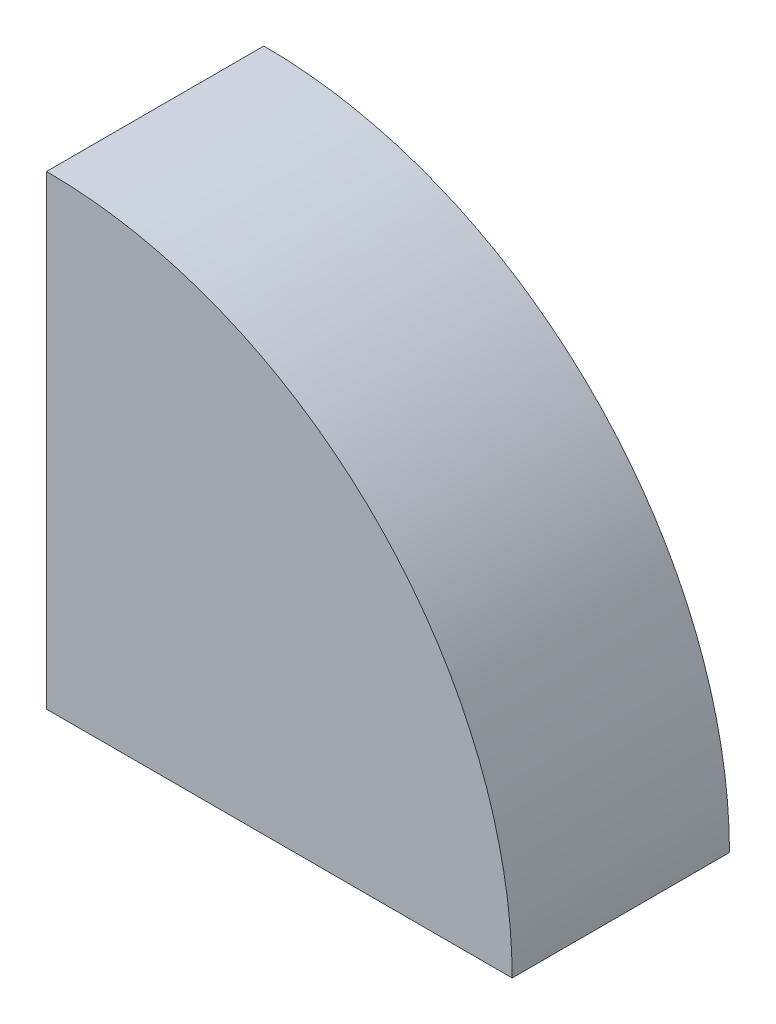
ISO-10303-21;
HEADER;
FILE_DESCRIPTION(('STEP AP214'),'2;1');
FILE_NAME('part.step','',(''),(''),'','','');
FILE_SCHEMA(('AUTOMOTIVE_DESIGN { 1 0 10303 214 1 1 1 1 }'));
ENDSEC;
DATA;
#1=APPLICATION_CONTEXT('core data for automotive mechanical design processes');
#2=APPLICATION_PROTOCOL_DEFINITION('international standard','automotive_design',2000,#1);
#3=PRODUCT_CONTEXT('',#1,'mechanical');
#4=PRODUCT('Part','Part','',(#3));
#5=PRODUCT_RELATED_PRODUCT_CATEGORY('part','',(#4));
#6=PRODUCT_DEFINITION_FORMATION('','',#4);
#7=PRODUCT_DEFINITION_CONTEXT('part definition',#1,'design');
#8=PRODUCT_DEFINITION('design','',#6,#7);
#9=PRODUCT_DEFINITION_SHAPE('','',#8);
#10=(LENGTH_UNIT() NAMED_UNIT(*) SI_UNIT(.MILLI.,.METRE.));
#11=(NAMED_UNIT(*) PLANE_ANGLE_UNIT() SI_UNIT($,.RADIAN.));
#12=(NAMED_UNIT(*) SI_UNIT($,.STERADIAN.) SOLID_ANGLE_UNIT());
#13=UNCERTAINTY_MEASURE_WITH_UNIT(LENGTH_MEASURE(1.E-05),#10,'distance_accuracy_value','');
#14=(GEOMETRIC_REPRESENTATION_CONTEXT(3) GLOBAL_UNCERTAINTY_ASSIGNED_CONTEXT((#13)) GLOBAL_UNIT_ASSIGNED_CONTEXT((#10,
#11,#12)) REPRESENTATION_CONTEXT('',''));
#15=CARTESIAN_POINT('',(0.,0.,0.));
#16=DIRECTION('',(0.,0.,1.));
#17=DIRECTION('',(1.,0.,0.));
#18=AXIS2_PLACEMENT_3D('',#15,#16,#17);
#19=CARTESIAN_POINT('',(2.2,2.2,108.483787187234));
#20=DIRECTION('',(0.,0.,-1.));
#21=DIRECTION('',(-1.,0.,0.));
#22=AXIS2_PLACEMENT_3D('',#19,#20,#21);
#23=CYLINDRICAL_SURFACE('',#22,55.8);
#24=DIRECTION('',(0.,0.,-1.));
#25=VECTOR('',#24,1.);
#26=CARTESIAN_POINT('',(2.2,58.,108.483787187234));
#27=LINE('',#26,#25);
#28=CARTESIAN_POINT('',(2.19999999999995,58.,20.8));
#29=VERTEX_POINT('',#28);
#30=CARTESIAN_POINT('',(2.19999999999995,58.,7.2));
#31=VERTEX_POINT('',#30);
#32=EDGE_CURVE('E517',#29,#31,#27,.T.);
#33=ORIENTED_EDGE('',*,*,#32,.T.);
#34=CARTESIAN_POINT('',(2.2,2.2,7.2));
#35=DIRECTION('',(0.,0.,-1.));
#36=DIRECTION('',(0.,1.,0.));
#37=AXIS2_PLACEMENT_3D('',#34,#35,#36);
#38=CIRCLE('',#37,55.8);
#39=CARTESIAN_POINT('',(3.49999999999996,57.9848545754132,7.2));
#40=VERTEX_POINT('',#39);
#41=EDGE_CURVE('E514',#31,#40,#38,.T.);
#42=ORIENTED_EDGE('',*,*,#41,.T.);
#43=DIRECTION('',(0.,0.,-1.));
#44=VECTOR('',#43,1.);
#45=CARTESIAN_POINT('',(3.49999999999996,57.9848545754132,7.2));
#46=LINE('',#45,#44);
#47=CARTESIAN_POINT('',(3.49999999999996,57.9848545754132,3.4));
#48=VERTEX_POINT('',#47);
#49=EDGE_CURVE('E257',#40,#48,#46,.T.);
#50=ORIENTED_EDGE('',*,*,#49,.T.);
#51=CARTESIAN_POINT('',(2.19999999999995,58.,3.4));
#52=CARTESIAN_POINT('',(2.85008822457151,58.,3.4));
#53=CARTESIAN_POINT('',(3.49999999999996,57.9848545754132,3.4));
#54=B_SPLINE_CURVE_WITH_KNOTS('',2,(#51,#52,#53),.UNSPECIFIED.,.F.,.F.,(3,3),(0.,1.),.UNSPECIFIED.);
#55=CARTESIAN_POINT('',(2.19999999999995,58.,3.4));
#56=VERTEX_POINT('',#55);
#57=EDGE_CURVE('E266',#56,#48,#54,.T.);
#58=ORIENTED_EDGE('',*,*,#57,.F.);
#59=CARTESIAN_POINT('',(2.2,58.,2.));
#60=VERTEX_POINT('',#59);
#61=EDGE_CURVE('E439',#56,#60,#27,.T.);
#62=ORIENTED_EDGE('',*,*,#61,.T.);
#63=CARTESIAN_POINT('',(2.2,2.2,2.));
#64=DIRECTION('',(0.,0.,1.));
#65=DIRECTION('',(1.,0.,0.));
#66=AXIS2_PLACEMENT_3D('',#63,#64,#65);
#67=CIRCLE('',#66,55.8);
#68=CARTESIAN_POINT('',(58.,2.2,2.));
#69=VERTEX_POINT('',#68);
#70=EDGE_CURVE('E422',#69,#60,#67,.T.);
#71=ORIENTED_EDGE('',*,*,#70,.F.);
#72=DIRECTION('',(0.,0.,-1.));
#73=VECTOR('',#72,1.);
#74=CARTESIAN_POINT('',(58.,2.2,108.483787187234));
#75=LINE('',#74,#73);
#76=CARTESIAN_POINT('',(58.,2.2,3.4));
#77=VERTEX_POINT('',#76);
#78=EDGE_CURVE('E599',#77,#69,#75,.T.);
#79=ORIENTED_EDGE('',*,*,#78,.F.);
#80=CARTESIAN_POINT('',(2.2,2.2,3.4));
#81=DIRECTION('',(0.,0.,1.));
#82=DIRECTION('',(1.,0.,0.));
#83=AXIS2_PLACEMENT_3D('',#80,#81,#82);
#84=CIRCLE('',#83,55.8);
#85=CARTESIAN_POINT('',(57.9848545754132,3.50000000000013,3.4));
#86=VERTEX_POINT('',#85);
#87=EDGE_CURVE('E357',#77,#86,#84,.T.);
#88=ORIENTED_EDGE('',*,*,#87,.T.);
#89=DIRECTION('',(0.,0.,-1.));
#90=VECTOR('',#89,1.);
#91=CARTESIAN_POINT('',(57.9848545754132,3.5,7.2));
#92=LINE('',#91,#90);
#93=CARTESIAN_POINT('',(57.9848545754132,3.5,7.2));
#94=VERTEX_POINT('',#93);
#95=EDGE_CURVE('E348',#94,#86,#92,.T.);
#96=ORIENTED_EDGE('',*,*,#95,.F.);
#97=CARTESIAN_POINT('',(58.,2.20000000000001,7.2));
#98=CARTESIAN_POINT('',(58.,2.85008822457154,7.2));
#99=CARTESIAN_POINT('',(57.9848545754132,3.5,7.2));
#100=B_SPLINE_CURVE_WITH_KNOTS('',2,(#97,#98,#99),.UNSPECIFIED.,.F.,.F.,(3,3),(0.,1.),.UNSPECIFIED.);
#101=CARTESIAN_POINT('',(58.,2.2,7.2));
#102=VERTEX_POINT('',#101);
#103=EDGE_CURVE('E685',#102,#94,#100,.T.);
#104=ORIENTED_EDGE('',*,*,#103,.F.);
#105=CARTESIAN_POINT('',(58.,2.2,20.8));
#106=VERTEX_POINT('',#105);
#107=EDGE_CURVE('E448',#106,#102,#75,.T.);
#108=ORIENTED_EDGE('',*,*,#107,.F.);
#109=CARTESIAN_POINT('',(2.2,2.2,20.8));
#110=DIRECTION('',(0.,0.,1.));
#111=DIRECTION('',(1.,0.,0.));
#112=AXIS2_PLACEMENT_3D('',#109,#110,#111);
#113=CIRCLE('',#112,55.8);
#114=CARTESIAN_POINT('',(57.9848545754132,3.5000000000003,20.8));
#115=VERTEX_POINT('',#114);
#116=EDGE_CURVE('E434',#106,#115,#113,.T.);
#117=ORIENTED_EDGE('',*,*,#116,.T.);
#118=DIRECTION('',(0.,0.,1.));
#119=VECTOR('',#118,1.);
#120=CARTESIAN_POINT('',(57.9848545754132,3.5,20.8));
#121=LINE('',#120,#119);
#122=CARTESIAN_POINT('',(57.9848545754132,3.50000000000001,24.6));
#123=VERTEX_POINT('',#122);
#124=EDGE_CURVE('E673',#115,#123,#121,.T.);
#125=ORIENTED_EDGE('',*,*,#124,.T.);
#126=CARTESIAN_POINT('',(58.,2.2,24.6));
#127=CARTESIAN_POINT('',(58.,2.85008822457155,24.6));
#128=CARTESIAN_POINT('',(57.9848545754132,3.5,24.6));
#129=B_SPLINE_CURVE_WITH_KNOTS('',2,(#126,#127,#128),.UNSPECIFIED.,.F.,.F.,(3,3),(0.,1.),.UNSPECIFIED.);
#130=CARTESIAN_POINT('',(58.,2.19999999999999,24.6));
#131=VERTEX_POINT('',#130);
#132=EDGE_CURVE('E672',#131,#123,#129,.T.);
#133=ORIENTED_EDGE('',*,*,#132,.F.);
#134=CARTESIAN_POINT('',(58.,2.2,26.));
#135=VERTEX_POINT('',#134);
#136=EDGE_CURVE('E426',#135,#131,#75,.T.);
#137=ORIENTED_EDGE('',*,*,#136,.F.);
#138=CARTESIAN_POINT('',(2.2,2.2,26.));
#139=DIRECTION('',(0.,0.,1.));
#140=DIRECTION('',(1.,0.,0.));
#141=AXIS2_PLACEMENT_3D('',#138,#139,#140);
#142=CIRCLE('',#141,55.8);
#143=CARTESIAN_POINT('',(2.2,58.,26.));
#144=VERTEX_POINT('',#143);
#145=EDGE_CURVE('E421',#135,#144,#142,.T.);
#146=ORIENTED_EDGE('',*,*,#145,.T.);
#147=CARTESIAN_POINT('',(2.2,58.,24.6));
#148=VERTEX_POINT('',#147);
#149=EDGE_CURVE('E598',#144,#148,#27,.T.);
#150=ORIENTED_EDGE('',*,*,#149,.T.);
#151=CARTESIAN_POINT('',(2.2,2.2,24.6));
#152=DIRECTION('',(0.,0.,-1.));
#153=DIRECTION('',(0.,1.,0.));
#154=AXIS2_PLACEMENT_3D('',#151,#152,#153);
#155=CIRCLE('',#154,55.8);
#156=CARTESIAN_POINT('',(3.49999999999996,57.9848545754132,24.6));
#157=VERTEX_POINT('',#156);
#158=EDGE_CURVE('E543',#148,#157,#155,.T.);
#159=ORIENTED_EDGE('',*,*,#158,.T.);
#160=DIRECTION('',(0.,0.,1.));
#161=VECTOR('',#160,1.);
#162=CARTESIAN_POINT('',(3.49999999999996,57.9848545754132,20.8));
#163=LINE('',#162,#161);
#164=CARTESIAN_POINT('',(3.49999999999996,57.9848545754132,20.8));
#165=VERTEX_POINT('',#164);
#166=EDGE_CURVE('E537',#165,#157,#163,.T.);
#167=ORIENTED_EDGE('',*,*,#166,.F.);
#168=CARTESIAN_POINT('',(2.19999999999995,58.,20.8));
#169=CARTESIAN_POINT('',(2.85008822457152,58.,20.8));
#170=CARTESIAN_POINT('',(3.49999999999997,57.9848545754132,20.8));
#171=B_SPLINE_CURVE_WITH_KNOTS('',2,(#168,#169,#170),.UNSPECIFIED.,.F.,.F.,(3,3),(0.,1.),.UNSPECIFIED.);
#172=EDGE_CURVE('E341',#29,#165,#171,.T.);
#173=ORIENTED_EDGE('',*,*,#172,.F.);
#174=EDGE_LOOP('',(#33,#42,#50,#58,#62,#71,#79,#88,#96,#104,#108,#117,#125,#133,#137,#146,#150,
#159,#167,#173));
#175=FACE_BOUND('',#174,.T.);
#176=ADVANCED_FACE('F18',(#175),#23,.F.);
#177=CARTESIAN_POINT('',(0.,57.,28.));
#178=DIRECTION('',(0.,1.,0.));
#179=DIRECTION('',(0.,0.,1.));
#180=AXIS2_PLACEMENT_3D('',#177,#178,#179);
#181=PLANE('',#180);
#182=DIRECTION('',(0.,0.,-1.));
#183=VECTOR('',#182,1.);
#184=CARTESIAN_POINT('',(2.2,57.,108.483787187234));
#185=LINE('',#184,#183);
#186=CARTESIAN_POINT('',(2.19999999999999,57.,26.));
#187=VERTEX_POINT('',#186);
#188=CARTESIAN_POINT('',(2.19999999999996,57.,24.6));
#189=VERTEX_POINT('',#188);
#190=EDGE_CURVE('E440',#187,#189,#185,.T.);
#191=ORIENTED_EDGE('',*,*,#190,.F.);
#192=DIRECTION('',(-1.,0.,0.));
#193=VECTOR('',#192,1.);
#194=CARTESIAN_POINT('',(0.,57.,26.));
#195=LINE('',#194,#193);
#196=CARTESIAN_POINT('',(0.,57.,26.));
#197=VERTEX_POINT('',#196);
#198=EDGE_CURVE('E37',#187,#197,#195,.T.);
#199=ORIENTED_EDGE('',*,*,#198,.T.);
#200=DIRECTION('',(0.,0.,-1.));
#201=VECTOR('',#200,1.);
#202=CARTESIAN_POINT('',(0.,57.,28.));
#203=LINE('',#202,#201);
#204=CARTESIAN_POINT('',(0.,57.,0.));
#205=VERTEX_POINT('',#204);
#206=EDGE_CURVE('E29',#197,#205,#203,.T.);
#207=ORIENTED_EDGE('',*,*,#206,.T.);
#208=DIRECTION('',(1.,0.,0.));
#209=VECTOR('',#208,1.);
#210=CARTESIAN_POINT('',(0.,57.,0.));
#211=LINE('',#210,#209);
#212=CARTESIAN_POINT('',(5.,57.,0.));
#213=VERTEX_POINT('',#212);
#214=EDGE_CURVE('E654',#205,#213,#211,.T.);
#215=ORIENTED_EDGE('',*,*,#214,.T.);
#216=DIRECTION('',(0.,0.,-1.));
#217=VECTOR('',#216,1.);
#218=CARTESIAN_POINT('',(5.,57.,28.));
#219=LINE('',#218,#217);
#220=CARTESIAN_POINT('',(5.,57.,2.));
#221=VERTEX_POINT('',#220);
#222=EDGE_CURVE('E668',#221,#213,#219,.T.);
#223=ORIENTED_EDGE('',*,*,#222,.F.);
#224=DIRECTION('',(1.,0.,0.));
#225=VECTOR('',#224,1.);
#226=CARTESIAN_POINT('',(0.,57.,2.));
#227=LINE('',#226,#225);
#228=CARTESIAN_POINT('',(2.2,57.,2.));
#229=VERTEX_POINT('',#228);
#230=EDGE_CURVE('E611',#229,#221,#227,.T.);
#231=ORIENTED_EDGE('',*,*,#230,.F.);
#232=CARTESIAN_POINT('',(2.2,57.,3.4));
#233=VERTEX_POINT('',#232);
#234=EDGE_CURVE('E420',#233,#229,#185,.T.);
#235=ORIENTED_EDGE('',*,*,#234,.F.);
#236=DIRECTION('',(1.,0.,0.));
#237=VECTOR('',#236,1.);
#238=CARTESIAN_POINT('',(2.19999999999996,57.,3.4));
#239=LINE('',#238,#237);
#240=CARTESIAN_POINT('',(0.999999999999965,57.,3.4));
#241=VERTEX_POINT('',#240);
#242=EDGE_CURVE('E235',#241,#233,#239,.T.);
#243=ORIENTED_EDGE('',*,*,#242,.F.);
#244=DIRECTION('',(0.,0.,-1.));
#245=VECTOR('',#244,1.);
#246=CARTESIAN_POINT('',(0.999999999999965,57.,7.2));
#247=LINE('',#246,#245);
#248=CARTESIAN_POINT('',(0.999999999999965,57.,7.2));
#249=VERTEX_POINT('',#248);
#250=EDGE_CURVE('E264',#249,#241,#247,.T.);
#251=ORIENTED_EDGE('',*,*,#250,.F.);
#252=DIRECTION('',(1.,0.,0.));
#253=VECTOR('',#252,1.);
#254=CARTESIAN_POINT('',(2.19999999999996,57.,7.2));
#255=LINE('',#254,#253);
#256=CARTESIAN_POINT('',(2.19999999999996,57.,7.2));
#257=VERTEX_POINT('',#256);
#258=EDGE_CURVE('E249',#249,#257,#255,.T.);
#259=ORIENTED_EDGE('',*,*,#258,.T.);
#260=CARTESIAN_POINT('',(2.19999999999996,57.,20.8));
#261=VERTEX_POINT('',#260);
#262=EDGE_CURVE('E606',#261,#257,#185,.T.);
#263=ORIENTED_EDGE('',*,*,#262,.F.);
#264=DIRECTION('',(1.,0.,0.));
#265=VECTOR('',#264,1.);
#266=CARTESIAN_POINT('',(2.19999999999996,57.,20.8));
#267=LINE('',#266,#265);
#268=CARTESIAN_POINT('',(0.999999999999965,57.,20.8));
#269=VERTEX_POINT('',#268);
#270=EDGE_CURVE('E560',#269,#261,#267,.T.);
#271=ORIENTED_EDGE('',*,*,#270,.F.);
#272=DIRECTION('',(0.,0.,1.));
#273=VECTOR('',#272,1.);
#274=CARTESIAN_POINT('',(0.999999999999965,57.,20.8));
#275=LINE('',#274,#273);
#276=CARTESIAN_POINT('',(0.999999999999965,57.,24.6));
#277=VERTEX_POINT('',#276);
#278=EDGE_CURVE('E326',#269,#277,#275,.T.);
#279=ORIENTED_EDGE('',*,*,#278,.T.);
#280=DIRECTION('',(1.,0.,0.));
#281=VECTOR('',#280,1.);
#282=CARTESIAN_POINT('',(2.19999999999996,57.,24.6));
#283=LINE('',#282,#281);
#284=EDGE_CURVE('E522',#277,#189,#283,.T.);
#285=ORIENTED_EDGE('',*,*,#284,.T.);
#286=EDGE_LOOP('',(#191,#199,#207,#215,#223,#231,#235,#243,#251,#259,#263,#271,#279,#285));
#287=FACE_BOUND('',#286,.T.);
#288=ADVANCED_FACE('F471',(#287),#181,.F.);
#289=CARTESIAN_POINT('',(2.2,0.,108.483787187234));
#290=DIRECTION('',(-1.,0.,0.));
#291=DIRECTION('',(0.,0.,1.));
#292=AXIS2_PLACEMENT_3D('',#289,#290,#291);
#293=PLANE('',#292);
#294=DIRECTION('',(0.,1.,0.));
#295=VECTOR('',#294,1.);
#296=CARTESIAN_POINT('',(2.19999999999996,57.,7.2));
#297=LINE('',#296,#295);
#298=EDGE_CURVE('E252',#257,#31,#297,.T.);
#299=ORIENTED_EDGE('',*,*,#298,.T.);
#300=ORIENTED_EDGE('',*,*,#32,.F.);
#301=DIRECTION('',(0.,1.,0.));
#302=VECTOR('',#301,1.);
#303=CARTESIAN_POINT('',(2.19999999999996,57.,20.8));
#304=LINE('',#303,#302);
#305=EDGE_CURVE('E321',#261,#29,#304,.T.);
#306=ORIENTED_EDGE('',*,*,#305,.F.);
#307=ORIENTED_EDGE('',*,*,#262,.T.);
#308=EDGE_LOOP('',(#299,#300,#306,#307));
#309=FACE_BOUND('',#308,.T.);
#310=ADVANCED_FACE('F603',(#309),#293,.F.);
#311=ORIENTED_EDGE('',*,*,#61,.F.);
#312=DIRECTION('',(0.,1.,0.));
#313=VECTOR('',#312,1.);
#314=CARTESIAN_POINT('',(2.19999999999996,57.,3.4));
#315=LINE('',#314,#313);
#316=EDGE_CURVE('E260',#233,#56,#315,.T.);
#317=ORIENTED_EDGE('',*,*,#316,.F.);
#318=ORIENTED_EDGE('',*,*,#234,.T.);
#319=DIRECTION('',(0.,1.,0.));
#320=VECTOR('',#319,1.);
#321=CARTESIAN_POINT('',(2.2,0.,2.));
#322=LINE('',#321,#320);
#323=EDGE_CURVE('E417',#229,#60,#322,.T.);
#324=ORIENTED_EDGE('',*,*,#323,.T.);
#325=EDGE_LOOP('',(#311,#317,#318,#324));
#326=FACE_BOUND('',#325,.T.);
#327=ADVANCED_FACE('F596',(#326),#293,.F.);
#328=CARTESIAN_POINT('',(57.,0.,28.));
#329=DIRECTION('',(1.,0.,0.));
#330=DIRECTION('',(0.,0.,-1.));
#331=AXIS2_PLACEMENT_3D('',#328,#329,#330);
#332=PLANE('',#331);
#333=DIRECTION('',(0.,0.,-1.));
#334=VECTOR('',#333,1.);
#335=CARTESIAN_POINT('',(57.,0.,28.));
#336=LINE('',#335,#334);
#337=CARTESIAN_POINT('',(57.,0.,26.));
#338=VERTEX_POINT('',#337);
#339=CARTESIAN_POINT('',(57.,0.,0.));
#340=VERTEX_POINT('',#339);
#341=EDGE_CURVE('E45',#338,#340,#336,.T.);
#342=ORIENTED_EDGE('',*,*,#341,.F.);
#343=DIRECTION('',(0.,1.,0.));
#344=VECTOR('',#343,1.);
#345=CARTESIAN_POINT('',(57.,5.,26.));
#346=LINE('',#345,#344);
#347=CARTESIAN_POINT('',(57.,2.2,26.));
#348=VERTEX_POINT('',#347);
#349=EDGE_CURVE('E245',#338,#348,#346,.T.);
#350=ORIENTED_EDGE('',*,*,#349,.T.);
#351=DIRECTION('',(0.,0.,-1.));
#352=VECTOR('',#351,1.);
#353=CARTESIAN_POINT('',(57.,2.2,108.483787187234));
#354=LINE('',#353,#352);
#355=CARTESIAN_POINT('',(57.,2.2,24.6));
#356=VERTEX_POINT('',#355);
#357=EDGE_CURVE('E431',#348,#356,#354,.T.);
#358=ORIENTED_EDGE('',*,*,#357,.T.);
#359=DIRECTION('',(0.,1.,0.));
#360=VECTOR('',#359,1.);
#361=CARTESIAN_POINT('',(57.,2.2,24.6));
#362=LINE('',#361,#360);
#363=CARTESIAN_POINT('',(57.,1.,24.6));
#364=VERTEX_POINT('',#363);
#365=EDGE_CURVE('E680',#364,#356,#362,.T.);
#366=ORIENTED_EDGE('',*,*,#365,.F.);
#367=DIRECTION('',(0.,0.,1.));
#368=VECTOR('',#367,1.);
#369=CARTESIAN_POINT('',(57.,1.,20.8));
#370=LINE('',#369,#368);
#371=CARTESIAN_POINT('',(57.,1.,20.8));
#372=VERTEX_POINT('',#371);
#373=EDGE_CURVE('E678',#372,#364,#370,.T.);
#374=ORIENTED_EDGE('',*,*,#373,.F.);
#375=DIRECTION('',(0.,1.,0.));
#376=VECTOR('',#375,1.);
#377=CARTESIAN_POINT('',(57.,2.2,20.8));
#378=LINE('',#377,#376);
#379=CARTESIAN_POINT('',(57.,2.2,20.8));
#380=VERTEX_POINT('',#379);
#381=EDGE_CURVE('E409',#372,#380,#378,.T.);
#382=ORIENTED_EDGE('',*,*,#381,.T.);
#383=CARTESIAN_POINT('',(57.,2.2,7.2));
#384=VERTEX_POINT('',#383);
#385=EDGE_CURVE('E623',#380,#384,#354,.T.);
#386=ORIENTED_EDGE('',*,*,#385,.T.);
#387=DIRECTION('',(0.,1.,0.));
#388=VECTOR('',#387,1.);
#389=CARTESIAN_POINT('',(57.,2.2,7.2));
#390=LINE('',#389,#388);
#391=CARTESIAN_POINT('',(57.,1.,7.2));
#392=VERTEX_POINT('',#391);
#393=EDGE_CURVE('E329',#392,#384,#390,.T.);
#394=ORIENTED_EDGE('',*,*,#393,.F.);
#395=DIRECTION('',(0.,0.,-1.));
#396=VECTOR('',#395,1.);
#397=CARTESIAN_POINT('',(57.,1.,7.2));
#398=LINE('',#397,#396);
#399=CARTESIAN_POINT('',(57.,1.,3.4));
#400=VERTEX_POINT('',#399);
#401=EDGE_CURVE('E349',#392,#400,#398,.T.);
#402=ORIENTED_EDGE('',*,*,#401,.T.);
#403=DIRECTION('',(0.,1.,0.));
#404=VECTOR('',#403,1.);
#405=CARTESIAN_POINT('',(57.,2.2,3.4));
#406=LINE('',#405,#404);
#407=CARTESIAN_POINT('',(57.,2.2,3.4));
#408=VERTEX_POINT('',#407);
#409=EDGE_CURVE('E337',#400,#408,#406,.T.);
#410=ORIENTED_EDGE('',*,*,#409,.T.);
#411=CARTESIAN_POINT('',(57.,2.2,2.));
#412=VERTEX_POINT('',#411);
#413=EDGE_CURVE('E425',#408,#412,#354,.T.);
#414=ORIENTED_EDGE('',*,*,#413,.T.);
#415=DIRECTION('',(0.,-1.,0.));
#416=VECTOR('',#415,1.);
#417=CARTESIAN_POINT('',(57.,0.,2.));
#418=LINE('',#417,#416);
#419=CARTESIAN_POINT('',(57.,5.,2.));
#420=VERTEX_POINT('',#419);
#421=EDGE_CURVE('E430',#420,#412,#418,.T.);
#422=ORIENTED_EDGE('',*,*,#421,.F.);
#423=DIRECTION('',(0.,0.,-1.));
#424=VECTOR('',#423,1.);
#425=CARTESIAN_POINT('',(57.,5.,28.));
#426=LINE('',#425,#424);
#427=CARTESIAN_POINT('',(57.,5.,0.));
#428=VERTEX_POINT('',#427);
#429=EDGE_CURVE('E666',#420,#428,#426,.T.);
#430=ORIENTED_EDGE('',*,*,#429,.T.);
#431=DIRECTION('',(0.,-1.,0.));
#432=VECTOR('',#431,1.);
#433=CARTESIAN_POINT('',(57.,0.,0.));
#434=LINE('',#433,#432);
#435=EDGE_CURVE('E660',#428,#340,#434,.T.);
#436=ORIENTED_EDGE('',*,*,#435,.T.);
#437=EDGE_LOOP('',(#342,#350,#358,#366,#374,#382,#386,#394,#402,#410,#414,#422,#430,#436));
#438=FACE_BOUND('',#437,.T.);
#439=ADVANCED_FACE('F616',(#438),#332,.F.);
#440=CARTESIAN_POINT('',(0.,2.2,108.483787187234));
#441=DIRECTION('',(0.,1.,0.));
#442=DIRECTION('',(0.,0.,1.));
#443=AXIS2_PLACEMENT_3D('',#440,#441,#442);
#444=PLANE('',#443);
#445=ORIENTED_EDGE('',*,*,#107,.T.);
#446=DIRECTION('',(1.,0.,0.));
#447=VECTOR('',#446,1.);
#448=CARTESIAN_POINT('',(57.,2.2,7.2));
#449=LINE('',#448,#447);
#450=EDGE_CURVE('E351',#384,#102,#449,.T.);
#451=ORIENTED_EDGE('',*,*,#450,.F.);
#452=ORIENTED_EDGE('',*,*,#385,.F.);
#453=DIRECTION('',(1.,0.,0.));
#454=VECTOR('',#453,1.);
#455=CARTESIAN_POINT('',(57.,2.2,20.8));
#456=LINE('',#455,#454);
#457=EDGE_CURVE('E401',#380,#106,#456,.T.);
#458=ORIENTED_EDGE('',*,*,#457,.T.);
#459=EDGE_LOOP('',(#445,#451,#452,#458));
#460=FACE_BOUND('',#459,.T.);
#461=ADVANCED_FACE('F716',(#460),#444,.T.);
#462=DIRECTION('',(1.,0.,0.));
#463=VECTOR('',#462,1.);
#464=CARTESIAN_POINT('',(57.,2.2,3.4));
#465=LINE('',#464,#463);
#466=EDGE_CURVE('E333',#408,#77,#465,.T.);
#467=ORIENTED_EDGE('',*,*,#466,.T.);
#468=ORIENTED_EDGE('',*,*,#78,.T.);
#469=DIRECTION('',(1.,0.,0.));
#470=VECTOR('',#469,1.);
#471=CARTESIAN_POINT('',(0.,2.2,2.));
#472=LINE('',#471,#470);
#473=EDGE_CURVE('E427',#412,#69,#472,.T.);
#474=ORIENTED_EDGE('',*,*,#473,.F.);
#475=ORIENTED_EDGE('',*,*,#413,.F.);
#476=EDGE_LOOP('',(#467,#468,#474,#475));
#477=FACE_BOUND('',#476,.T.);
#478=ADVANCED_FACE('F632',(#477),#444,.T.);
#479=CARTESIAN_POINT('',(5.,57.,28.));
#480=DIRECTION('',(0.707106781186548,0.707106781186548,0.));
#481=DIRECTION('',(-0.707106781186548,0.707106781186547,0.));
#482=AXIS2_PLACEMENT_3D('',#479,#480,#481);
#483=PLANE('',#482);
#484=DIRECTION('',(0.707106781186548,-0.707106781186547,0.));
#485=VECTOR('',#484,1.);
#486=CARTESIAN_POINT('',(5.,57.,2.));
#487=LINE('',#486,#485);
#488=EDGE_CURVE('E637',#221,#420,#487,.T.);
#489=ORIENTED_EDGE('',*,*,#488,.F.);
#490=ORIENTED_EDGE('',*,*,#222,.T.);
#491=DIRECTION('',(0.707106781186548,-0.707106781186547,0.));
#492=VECTOR('',#491,1.);
#493=CARTESIAN_POINT('',(5.,57.,0.));
#494=LINE('',#493,#492);
#495=EDGE_CURVE('E657',#213,#428,#494,.T.);
#496=ORIENTED_EDGE('',*,*,#495,.T.);
#497=ORIENTED_EDGE('',*,*,#429,.F.);
#498=EDGE_LOOP('',(#489,#490,#496,#497));
#499=FACE_BOUND('',#498,.T.);
#500=ADVANCED_FACE('F748',(#499),#483,.F.);
#501=CARTESIAN_POINT('',(0.,0.,28.));
#502=DIRECTION('',(0.,0.,-1.));
#503=DIRECTION('',(-1.,0.,0.));
#504=AXIS2_PLACEMENT_3D('',#501,#502,#503);
#505=CYLINDRICAL_SURFACE('',#504,60.);
#506=CARTESIAN_POINT('',(0.,0.,0.));
#507=DIRECTION('',(0.,0.,1.));
#508=DIRECTION('',(1.,0.,0.));
#509=AXIS2_PLACEMENT_3D('',#506,#507,#508);
#510=CIRCLE('',#509,60.);
#511=CARTESIAN_POINT('',(60.,0.,0.));
#512=VERTEX_POINT('',#511);
#513=CARTESIAN_POINT('',(0.,60.,0.));
#514=VERTEX_POINT('',#513);
#515=EDGE_CURVE('E641',#512,#514,#510,.T.);
#516=ORIENTED_EDGE('',*,*,#515,.T.);
#517=DIRECTION('',(0.,0.,-1.));
#518=VECTOR('',#517,1.);
#519=CARTESIAN_POINT('',(0.,60.,28.));
#520=LINE('',#519,#518);
#521=CARTESIAN_POINT('',(0.,60.,28.));
#522=VERTEX_POINT('',#521);
#523=EDGE_CURVE('E11',#522,#514,#520,.T.);
#524=ORIENTED_EDGE('',*,*,#523,.F.);
#525=CARTESIAN_POINT('',(0.,0.,28.));
#526=DIRECTION('',(0.,0.,1.));
#527=DIRECTION('',(1.,0.,0.));
#528=AXIS2_PLACEMENT_3D('',#525,#526,#527);
#529=CIRCLE('',#528,60.);
#530=CARTESIAN_POINT('',(60.,0.,28.));
#531=VERTEX_POINT('',#530);
#532=EDGE_CURVE('E642',#531,#522,#529,.T.);
#533=ORIENTED_EDGE('',*,*,#532,.F.);
#534=DIRECTION('',(0.,0.,-1.));
#535=VECTOR('',#534,1.);
#536=CARTESIAN_POINT('',(60.,0.,28.));
#537=LINE('',#536,#535);
#538=EDGE_CURVE('E649',#531,#512,#537,.T.);
#539=ORIENTED_EDGE('',*,*,#538,.T.);
#540=EDGE_LOOP('',(#516,#524,#533,#539));
#541=FACE_BOUND('',#540,.T.);
#542=ADVANCED_FACE('F20',(#541),#505,.T.);
#543=CARTESIAN_POINT('',(0.,60.,28.));
#544=DIRECTION('',(1.,0.,0.));
#545=DIRECTION('',(0.,1.,0.));
#546=AXIS2_PLACEMENT_3D('',#543,#544,#545);
#547=PLANE('',#546);
#548=DIRECTION('',(0.,-1.,0.));
#549=VECTOR('',#548,1.);
#550=CARTESIAN_POINT('',(0.,60.,0.));
#551=LINE('',#550,#549);
#552=EDGE_CURVE('E652',#514,#205,#551,.T.);
#553=ORIENTED_EDGE('',*,*,#552,.T.);
#554=ORIENTED_EDGE('',*,*,#206,.F.);
#555=DIRECTION('',(0.,-1.,0.));
#556=VECTOR('',#555,1.);
#557=CARTESIAN_POINT('',(0.,0.,26.));
#558=LINE('',#557,#556);
#559=CARTESIAN_POINT('',(0.,0.,26.));
#560=VERTEX_POINT('',#559);
#561=EDGE_CURVE('E238',#197,#560,#558,.T.);
#562=ORIENTED_EDGE('',*,*,#561,.T.);
#563=DIRECTION('',(0.,0.,1.));
#564=VECTOR('',#563,1.);
#565=CARTESIAN_POINT('',(0.,0.,26.));
#566=LINE('',#565,#564);
#567=CARTESIAN_POINT('',(0.,0.,28.));
#568=VERTEX_POINT('',#567);
#569=EDGE_CURVE('E226',#560,#568,#566,.T.);
#570=ORIENTED_EDGE('',*,*,#569,.T.);
#571=DIRECTION('',(0.,-1.,0.));
#572=VECTOR('',#571,1.);
#573=CARTESIAN_POINT('',(0.,60.,28.));
#574=LINE('',#573,#572);
#575=EDGE_CURVE('E645',#522,#568,#574,.T.);
#576=ORIENTED_EDGE('',*,*,#575,.F.);
#577=ORIENTED_EDGE('',*,*,#523,.T.);
#578=EDGE_LOOP('',(#553,#554,#562,#570,#576,#577));
#579=FACE_BOUND('',#578,.T.);
#580=ADVANCED_FACE('F240',(#579),#547,.F.);
#581=CARTESIAN_POINT('',(60.,0.,28.));
#582=DIRECTION('',(0.,1.,0.));
#583=DIRECTION('',(-1.,0.,0.));
#584=AXIS2_PLACEMENT_3D('',#581,#582,#583);
#585=PLANE('',#584);
#586=DIRECTION('',(1.,0.,0.));
#587=VECTOR('',#586,1.);
#588=CARTESIAN_POINT('',(60.,0.,0.));
#589=LINE('',#588,#587);
#590=EDGE_CURVE('E646',#340,#512,#589,.T.);
#591=ORIENTED_EDGE('',*,*,#590,.T.);
#592=ORIENTED_EDGE('',*,*,#538,.F.);
#593=DIRECTION('',(1.,0.,0.));
#594=VECTOR('',#593,1.);
#595=CARTESIAN_POINT('',(60.,0.,28.));
#596=LINE('',#595,#594);
#597=EDGE_CURVE('E232',#568,#531,#596,.T.);
#598=ORIENTED_EDGE('',*,*,#597,.F.);
#599=ORIENTED_EDGE('',*,*,#569,.F.);
#600=DIRECTION('',(1.,0.,0.));
#601=VECTOR('',#600,1.);
#602=CARTESIAN_POINT('',(57.,0.,26.));
#603=LINE('',#602,#601);
#604=EDGE_CURVE('E230',#560,#338,#603,.T.);
#605=ORIENTED_EDGE('',*,*,#604,.T.);
#606=ORIENTED_EDGE('',*,*,#341,.T.);
#607=EDGE_LOOP('',(#591,#592,#598,#599,#605,#606));
#608=FACE_BOUND('',#607,.T.);
#609=ADVANCED_FACE('F228',(#608),#585,.F.);
#610=CARTESIAN_POINT('',(0.,0.,28.));
#611=DIRECTION('',(0.,0.,1.));
#612=DIRECTION('',(1.,0.,0.));
#613=AXIS2_PLACEMENT_3D('',#610,#611,#612);
#614=PLANE('',#613);
#615=ORIENTED_EDGE('',*,*,#575,.T.);
#616=ORIENTED_EDGE('',*,*,#597,.T.);
#617=ORIENTED_EDGE('',*,*,#532,.T.);
#618=EDGE_LOOP('',(#615,#616,#617));
#619=FACE_BOUND('',#618,.T.);
#620=ADVANCED_FACE('F760',(#619),#614,.T.);
#621=CARTESIAN_POINT('',(0.,0.,0.));
#622=DIRECTION('',(0.,0.,1.));
#623=DIRECTION('',(1.,0.,0.));
#624=AXIS2_PLACEMENT_3D('',#621,#622,#623);
#625=PLANE('',#624);
#626=ORIENTED_EDGE('',*,*,#515,.F.);
#627=ORIENTED_EDGE('',*,*,#590,.F.);
#628=ORIENTED_EDGE('',*,*,#435,.F.);
#629=ORIENTED_EDGE('',*,*,#495,.F.);
#630=ORIENTED_EDGE('',*,*,#214,.F.);
#631=ORIENTED_EDGE('',*,*,#552,.F.);
#632=EDGE_LOOP('',(#626,#627,#628,#629,#630,#631));
#633=FACE_BOUND('',#632,.T.);
#634=ADVANCED_FACE('F754',(#633),#625,.F.);
#635=CARTESIAN_POINT('',(0.,0.,26.));
#636=DIRECTION('',(0.,0.,1.));
#637=DIRECTION('',(1.,0.,0.));
#638=AXIS2_PLACEMENT_3D('',#635,#636,#637);
#639=PLANE('',#638);
#640=DIRECTION('',(1.,0.,0.));
#641=VECTOR('',#640,1.);
#642=CARTESIAN_POINT('',(0.,2.2,26.));
#643=LINE('',#642,#641);
#644=EDGE_CURVE('E432',#348,#135,#643,.T.);
#645=ORIENTED_EDGE('',*,*,#644,.F.);
#646=ORIENTED_EDGE('',*,*,#349,.F.);
#647=ORIENTED_EDGE('',*,*,#604,.F.);
#648=ORIENTED_EDGE('',*,*,#561,.F.);
#649=ORIENTED_EDGE('',*,*,#198,.F.);
#650=DIRECTION('',(0.,1.,0.));
#651=VECTOR('',#650,1.);
#652=CARTESIAN_POINT('',(2.2,0.,26.));
#653=LINE('',#652,#651);
#654=EDGE_CURVE('E436',#187,#144,#653,.T.);
#655=ORIENTED_EDGE('',*,*,#654,.T.);
#656=ORIENTED_EDGE('',*,*,#145,.F.);
#657=EDGE_LOOP('',(#645,#646,#647,#648,#649,#655,#656));
#658=FACE_BOUND('',#657,.T.);
#659=ADVANCED_FACE('F244',(#658),#639,.F.);
#660=CARTESIAN_POINT('',(0.,0.,2.));
#661=DIRECTION('',(0.,0.,1.));
#662=DIRECTION('',(1.,0.,0.));
#663=AXIS2_PLACEMENT_3D('',#660,#661,#662);
#664=PLANE('',#663);
#665=ORIENTED_EDGE('',*,*,#230,.T.);
#666=ORIENTED_EDGE('',*,*,#488,.T.);
#667=ORIENTED_EDGE('',*,*,#421,.T.);
#668=ORIENTED_EDGE('',*,*,#473,.T.);
#669=ORIENTED_EDGE('',*,*,#70,.T.);
#670=ORIENTED_EDGE('',*,*,#323,.F.);
#671=EDGE_LOOP('',(#665,#666,#667,#668,#669,#670));
#672=FACE_BOUND('',#671,.T.);
#673=ADVANCED_FACE('F635',(#672),#664,.T.);
#674=ORIENTED_EDGE('',*,*,#190,.T.);
#675=DIRECTION('',(0.,1.,0.));
#676=VECTOR('',#675,1.);
#677=CARTESIAN_POINT('',(2.19999999999996,57.,24.6));
#678=LINE('',#677,#676);
#679=EDGE_CURVE('E557',#189,#148,#678,.T.);
#680=ORIENTED_EDGE('',*,*,#679,.T.);
#681=ORIENTED_EDGE('',*,*,#149,.F.);
#682=ORIENTED_EDGE('',*,*,#654,.F.);
#683=EDGE_LOOP('',(#674,#680,#681,#682));
#684=FACE_BOUND('',#683,.T.);
#685=ADVANCED_FACE('F474',(#684),#293,.F.);
#686=DIRECTION('',(1.,0.,0.));
#687=VECTOR('',#686,1.);
#688=CARTESIAN_POINT('',(57.,2.2,24.6));
#689=LINE('',#688,#687);
#690=EDGE_CURVE('E622',#356,#131,#689,.T.);
#691=ORIENTED_EDGE('',*,*,#690,.F.);
#692=ORIENTED_EDGE('',*,*,#357,.F.);
#693=ORIENTED_EDGE('',*,*,#644,.T.);
#694=ORIENTED_EDGE('',*,*,#136,.T.);
#695=EDGE_LOOP('',(#691,#692,#693,#694));
#696=FACE_BOUND('',#695,.T.);
#697=ADVANCED_FACE('F472',(#696),#444,.T.);
#698=CARTESIAN_POINT('',(57.,1.,20.8));
#699=DIRECTION('',(0.,-1.,0.));
#700=DIRECTION('',(1.,0.,0.));
#701=AXIS2_PLACEMENT_3D('',#698,#699,#700);
#702=PLANE('',#701);
#703=DIRECTION('',(1.,0.,0.));
#704=VECTOR('',#703,1.);
#705=CARTESIAN_POINT('',(57.,1.,24.6));
#706=LINE('',#705,#704);
#707=CARTESIAN_POINT('',(54.,1.,24.6));
#708=VERTEX_POINT('',#707);
#709=EDGE_CURVE('E683',#708,#364,#706,.T.);
#710=ORIENTED_EDGE('',*,*,#709,.F.);
#711=DIRECTION('',(0.,0.,1.));
#712=VECTOR('',#711,1.);
#713=CARTESIAN_POINT('',(54.,1.,20.8));
#714=LINE('',#713,#712);
#715=CARTESIAN_POINT('',(54.,1.,20.8));
#716=VERTEX_POINT('',#715);
#717=EDGE_CURVE('E694',#716,#708,#714,.T.);
#718=ORIENTED_EDGE('',*,*,#717,.F.);
#719=DIRECTION('',(1.,0.,0.));
#720=VECTOR('',#719,1.);
#721=CARTESIAN_POINT('',(57.,1.,20.8));
#722=LINE('',#721,#720);
#723=EDGE_CURVE('E414',#716,#372,#722,.T.);
#724=ORIENTED_EDGE('',*,*,#723,.T.);
#725=ORIENTED_EDGE('',*,*,#373,.T.);
#726=EDGE_LOOP('',(#710,#718,#724,#725));
#727=FACE_BOUND('',#726,.T.);
#728=ADVANCED_FACE('F708',(#727),#702,.T.);
#729=CARTESIAN_POINT('',(54.,1.,20.8));
#730=DIRECTION('',(-0.531445172944289,0.847092691595326,0.));
#731=DIRECTION('',(-0.847092691595326,-0.531445172944289,0.));
#732=AXIS2_PLACEMENT_3D('',#729,#730,#731);
#733=PLANE('',#732);
#734=DIRECTION('',(-0.847092691595326,-0.531445172944289,0.));
#735=VECTOR('',#734,1.);
#736=CARTESIAN_POINT('',(54.,1.,24.6));
#737=LINE('',#736,#735);
#738=EDGE_CURVE('E681',#123,#708,#737,.T.);
#739=ORIENTED_EDGE('',*,*,#738,.F.);
#740=ORIENTED_EDGE('',*,*,#124,.F.);
#741=DIRECTION('',(-0.847092691595326,-0.531445172944289,0.));
#742=VECTOR('',#741,1.);
#743=CARTESIAN_POINT('',(54.,1.,20.8));
#744=LINE('',#743,#742);
#745=EDGE_CURVE('E408',#115,#716,#744,.T.);
#746=ORIENTED_EDGE('',*,*,#745,.T.);
#747=ORIENTED_EDGE('',*,*,#717,.T.);
#748=EDGE_LOOP('',(#739,#740,#746,#747));
#749=FACE_BOUND('',#748,.T.);
#750=ADVANCED_FACE('F390',(#749),#733,.T.);
#751=CARTESIAN_POINT('',(32.2023678680238,2.54953738459258,20.8));
#752=DIRECTION('',(0.,0.,1.));
#753=DIRECTION('',(1.,0.,0.));
#754=AXIS2_PLACEMENT_3D('',#751,#752,#753);
#755=PLANE('',#754);
#756=ORIENTED_EDGE('',*,*,#116,.F.);
#757=ORIENTED_EDGE('',*,*,#457,.F.);
#758=ORIENTED_EDGE('',*,*,#381,.F.);
#759=ORIENTED_EDGE('',*,*,#723,.F.);
#760=ORIENTED_EDGE('',*,*,#745,.F.);
#761=EDGE_LOOP('',(#756,#757,#758,#759,#760));
#762=FACE_BOUND('',#761,.T.);
#763=ADVANCED_FACE('F386',(#762),#755,.F.);
#764=CARTESIAN_POINT('',(32.2023678680238,2.54953738459258,24.6));
#765=DIRECTION('',(0.,0.,1.));
#766=DIRECTION('',(1.,0.,0.));
#767=AXIS2_PLACEMENT_3D('',#764,#765,#766);
#768=PLANE('',#767);
#769=ORIENTED_EDGE('',*,*,#690,.T.);
#770=ORIENTED_EDGE('',*,*,#132,.T.);
#771=ORIENTED_EDGE('',*,*,#738,.T.);
#772=ORIENTED_EDGE('',*,*,#709,.T.);
#773=ORIENTED_EDGE('',*,*,#365,.T.);
#774=EDGE_LOOP('',(#769,#770,#771,#772,#773));
#775=FACE_BOUND('',#774,.T.);
#776=ADVANCED_FACE('F381',(#775),#768,.T.);
#777=CARTESIAN_POINT('',(54.,1.,7.2));
#778=DIRECTION('',(0.531445172944289,-0.847092691595326,0.));
#779=DIRECTION('',(0.847092691595326,0.531445172944289,0.));
#780=AXIS2_PLACEMENT_3D('',#777,#778,#779);
#781=PLANE('',#780);
#782=DIRECTION('',(-0.847092691595326,-0.531445172944289,0.));
#783=VECTOR('',#782,1.);
#784=CARTESIAN_POINT('',(54.,1.,3.4));
#785=LINE('',#784,#783);
#786=CARTESIAN_POINT('',(54.,1.,3.4));
#787=VERTEX_POINT('',#786);
#788=EDGE_CURVE('E344',#86,#787,#785,.T.);
#789=ORIENTED_EDGE('',*,*,#788,.T.);
#790=DIRECTION('',(0.,0.,-1.));
#791=VECTOR('',#790,1.);
#792=CARTESIAN_POINT('',(54.,1.,7.2));
#793=LINE('',#792,#791);
#794=CARTESIAN_POINT('',(54.,1.,7.2));
#795=VERTEX_POINT('',#794);
#796=EDGE_CURVE('E345',#795,#787,#793,.T.);
#797=ORIENTED_EDGE('',*,*,#796,.F.);
#798=DIRECTION('',(-0.847092691595326,-0.531445172944289,0.));
#799=VECTOR('',#798,1.);
#800=CARTESIAN_POINT('',(54.,1.,7.2));
#801=LINE('',#800,#799);
#802=EDGE_CURVE('E336',#94,#795,#801,.T.);
#803=ORIENTED_EDGE('',*,*,#802,.F.);
#804=ORIENTED_EDGE('',*,*,#95,.T.);
#805=EDGE_LOOP('',(#789,#797,#803,#804));
#806=FACE_BOUND('',#805,.T.);
#807=ADVANCED_FACE('F377',(#806),#781,.F.);
#808=CARTESIAN_POINT('',(57.,1.,7.2));
#809=DIRECTION('',(0.,1.,0.));
#810=DIRECTION('',(-1.,0.,0.));
#811=AXIS2_PLACEMENT_3D('',#808,#809,#810);
#812=PLANE('',#811);
#813=DIRECTION('',(1.,0.,0.));
#814=VECTOR('',#813,1.);
#815=CARTESIAN_POINT('',(57.,1.,3.4));
#816=LINE('',#815,#814);
#817=EDGE_CURVE('E340',#787,#400,#816,.T.);
#818=ORIENTED_EDGE('',*,*,#817,.T.);
#819=ORIENTED_EDGE('',*,*,#401,.F.);
#820=DIRECTION('',(1.,0.,0.));
#821=VECTOR('',#820,1.);
#822=CARTESIAN_POINT('',(57.,1.,7.2));
#823=LINE('',#822,#821);
#824=EDGE_CURVE('E332',#795,#392,#823,.T.);
#825=ORIENTED_EDGE('',*,*,#824,.F.);
#826=ORIENTED_EDGE('',*,*,#796,.T.);
#827=EDGE_LOOP('',(#818,#819,#825,#826));
#828=FACE_BOUND('',#827,.T.);
#829=ADVANCED_FACE('F380',(#828),#812,.F.);
#830=CARTESIAN_POINT('',(32.2023678680238,2.54953738459258,7.2));
#831=DIRECTION('',(0.,0.,-1.));
#832=DIRECTION('',(1.,0.,0.));
#833=AXIS2_PLACEMENT_3D('',#830,#831,#832);
#834=PLANE('',#833);
#835=ORIENTED_EDGE('',*,*,#103,.T.);
#836=ORIENTED_EDGE('',*,*,#802,.T.);
#837=ORIENTED_EDGE('',*,*,#824,.T.);
#838=ORIENTED_EDGE('',*,*,#393,.T.);
#839=ORIENTED_EDGE('',*,*,#450,.T.);
#840=EDGE_LOOP('',(#835,#836,#837,#838,#839));
#841=FACE_BOUND('',#840,.T.);
#842=ADVANCED_FACE('F374',(#841),#834,.F.);
#843=CARTESIAN_POINT('',(32.2023678680238,2.54953738459258,3.4));
#844=DIRECTION('',(0.,0.,-1.));
#845=DIRECTION('',(1.,0.,0.));
#846=AXIS2_PLACEMENT_3D('',#843,#844,#845);
#847=PLANE('',#846);
#848=ORIENTED_EDGE('',*,*,#788,.F.);
#849=ORIENTED_EDGE('',*,*,#87,.F.);
#850=ORIENTED_EDGE('',*,*,#466,.F.);
#851=ORIENTED_EDGE('',*,*,#409,.F.);
#852=ORIENTED_EDGE('',*,*,#817,.F.);
#853=EDGE_LOOP('',(#848,#849,#850,#851,#852));
#854=FACE_BOUND('',#853,.T.);
#855=ADVANCED_FACE('F363',(#854),#847,.T.);
#856=CARTESIAN_POINT('',(0.999999999999966,54.,20.8));
#857=DIRECTION('',(-0.847092691595327,0.531445172944289,0.));
#858=DIRECTION('',(-0.531445172944289,-0.847092691595327,0.));
#859=AXIS2_PLACEMENT_3D('',#856,#857,#858);
#860=PLANE('',#859);
#861=DIRECTION('',(-0.531445172944288,-0.847092691595327,0.));
#862=VECTOR('',#861,1.);
#863=CARTESIAN_POINT('',(0.999999999999966,54.,24.6));
#864=LINE('',#863,#862);
#865=CARTESIAN_POINT('',(0.999999999999966,54.,24.6));
#866=VERTEX_POINT('',#865);
#867=EDGE_CURVE('E529',#157,#866,#864,.T.);
#868=ORIENTED_EDGE('',*,*,#867,.T.);
#869=DIRECTION('',(0.,0.,1.));
#870=VECTOR('',#869,1.);
#871=CARTESIAN_POINT('',(0.999999999999966,54.,20.8));
#872=LINE('',#871,#870);
#873=CARTESIAN_POINT('',(0.999999999999966,54.,20.8));
#874=VERTEX_POINT('',#873);
#875=EDGE_CURVE('E534',#874,#866,#872,.T.);
#876=ORIENTED_EDGE('',*,*,#875,.F.);
#877=DIRECTION('',(-0.531445172944288,-0.847092691595327,0.));
#878=VECTOR('',#877,1.);
#879=CARTESIAN_POINT('',(0.999999999999966,54.,20.8));
#880=LINE('',#879,#878);
#881=EDGE_CURVE('E314',#165,#874,#880,.T.);
#882=ORIENTED_EDGE('',*,*,#881,.F.);
#883=ORIENTED_EDGE('',*,*,#166,.T.);
#884=EDGE_LOOP('',(#868,#876,#882,#883));
#885=FACE_BOUND('',#884,.T.);
#886=ADVANCED_FACE('F373',(#885),#860,.F.);
#887=CARTESIAN_POINT('',(0.999999999999965,57.,20.8));
#888=DIRECTION('',(1.,0.,0.));
#889=DIRECTION('',(0.,1.,0.));
#890=AXIS2_PLACEMENT_3D('',#887,#888,#889);
#891=PLANE('',#890);
#892=DIRECTION('',(0.,1.,0.));
#893=VECTOR('',#892,1.);
#894=CARTESIAN_POINT('',(0.999999999999965,57.,24.6));
#895=LINE('',#894,#893);
#896=EDGE_CURVE('E524',#866,#277,#895,.T.);
#897=ORIENTED_EDGE('',*,*,#896,.T.);
#898=ORIENTED_EDGE('',*,*,#278,.F.);
#899=DIRECTION('',(0.,1.,0.));
#900=VECTOR('',#899,1.);
#901=CARTESIAN_POINT('',(0.999999999999965,57.,20.8));
#902=LINE('',#901,#900);
#903=EDGE_CURVE('E322',#874,#269,#902,.T.);
#904=ORIENTED_EDGE('',*,*,#903,.F.);
#905=ORIENTED_EDGE('',*,*,#875,.T.);
#906=EDGE_LOOP('',(#897,#898,#904,#905));
#907=FACE_BOUND('',#906,.T.);
#908=ADVANCED_FACE('F304',(#907),#891,.F.);
#909=CARTESIAN_POINT('',(2.54953738459256,32.2023678680238,20.8));
#910=DIRECTION('',(0.,0.,1.));
#911=DIRECTION('',(0.,1.,0.));
#912=AXIS2_PLACEMENT_3D('',#909,#910,#911);
#913=PLANE('',#912);
#914=ORIENTED_EDGE('',*,*,#172,.T.);
#915=ORIENTED_EDGE('',*,*,#881,.T.);
#916=ORIENTED_EDGE('',*,*,#903,.T.);
#917=ORIENTED_EDGE('',*,*,#270,.T.);
#918=ORIENTED_EDGE('',*,*,#305,.T.);
#919=EDGE_LOOP('',(#914,#915,#916,#917,#918));
#920=FACE_BOUND('',#919,.T.);
#921=ADVANCED_FACE('F300',(#920),#913,.F.);
#922=CARTESIAN_POINT('',(2.54953738459256,32.2023678680238,24.6));
#923=DIRECTION('',(0.,0.,1.));
#924=DIRECTION('',(0.,1.,0.));
#925=AXIS2_PLACEMENT_3D('',#922,#923,#924);
#926=PLANE('',#925);
#927=ORIENTED_EDGE('',*,*,#867,.F.);
#928=ORIENTED_EDGE('',*,*,#158,.F.);
#929=ORIENTED_EDGE('',*,*,#679,.F.);
#930=ORIENTED_EDGE('',*,*,#284,.F.);
#931=ORIENTED_EDGE('',*,*,#896,.F.);
#932=EDGE_LOOP('',(#927,#928,#929,#930,#931));
#933=FACE_BOUND('',#932,.T.);
#934=ADVANCED_FACE('F295',(#933),#926,.T.);
#935=CARTESIAN_POINT('',(0.999999999999965,57.,7.2));
#936=DIRECTION('',(-1.,0.,0.));
#937=DIRECTION('',(0.,-1.,0.));
#938=AXIS2_PLACEMENT_3D('',#935,#936,#937);
#939=PLANE('',#938);
#940=DIRECTION('',(0.,1.,0.));
#941=VECTOR('',#940,1.);
#942=CARTESIAN_POINT('',(0.999999999999965,57.,3.4));
#943=LINE('',#942,#941);
#944=CARTESIAN_POINT('',(0.999999999999966,54.,3.4));
#945=VERTEX_POINT('',#944);
#946=EDGE_CURVE('E253',#945,#241,#943,.T.);
#947=ORIENTED_EDGE('',*,*,#946,.F.);
#948=DIRECTION('',(0.,0.,-1.));
#949=VECTOR('',#948,1.);
#950=CARTESIAN_POINT('',(0.999999999999966,54.,7.2));
#951=LINE('',#950,#949);
#952=CARTESIAN_POINT('',(0.999999999999966,54.,7.2));
#953=VERTEX_POINT('',#952);
#954=EDGE_CURVE('E267',#953,#945,#951,.T.);
#955=ORIENTED_EDGE('',*,*,#954,.F.);
#956=DIRECTION('',(0.,1.,0.));
#957=VECTOR('',#956,1.);
#958=CARTESIAN_POINT('',(0.999999999999965,57.,7.2));
#959=LINE('',#958,#957);
#960=EDGE_CURVE('E254',#953,#249,#959,.T.);
#961=ORIENTED_EDGE('',*,*,#960,.T.);
#962=ORIENTED_EDGE('',*,*,#250,.T.);
#963=EDGE_LOOP('',(#947,#955,#961,#962));
#964=FACE_BOUND('',#963,.T.);
#965=ADVANCED_FACE('F291',(#964),#939,.T.);
#966=CARTESIAN_POINT('',(0.999999999999966,54.,7.2));
#967=DIRECTION('',(0.847092691595327,-0.531445172944289,0.));
#968=DIRECTION('',(0.531445172944289,0.847092691595327,0.));
#969=AXIS2_PLACEMENT_3D('',#966,#967,#968);
#970=PLANE('',#969);
#971=DIRECTION('',(-0.531445172944288,-0.847092691595327,0.));
#972=VECTOR('',#971,1.);
#973=CARTESIAN_POINT('',(0.999999999999966,54.,3.4));
#974=LINE('',#973,#972);
#975=EDGE_CURVE('E263',#48,#945,#974,.T.);
#976=ORIENTED_EDGE('',*,*,#975,.F.);
#977=ORIENTED_EDGE('',*,*,#49,.F.);
#978=DIRECTION('',(-0.531445172944288,-0.847092691595327,0.));
#979=VECTOR('',#978,1.);
#980=CARTESIAN_POINT('',(0.999999999999966,54.,7.2));
#981=LINE('',#980,#979);
#982=EDGE_CURVE('E258',#40,#953,#981,.T.);
#983=ORIENTED_EDGE('',*,*,#982,.T.);
#984=ORIENTED_EDGE('',*,*,#954,.T.);
#985=EDGE_LOOP('',(#976,#977,#983,#984));
#986=FACE_BOUND('',#985,.T.);
#987=ADVANCED_FACE('F294',(#986),#970,.T.);
#988=CARTESIAN_POINT('',(2.54953738459256,32.2023678680238,7.2));
#989=DIRECTION('',(0.,0.,-1.));
#990=DIRECTION('',(0.,1.,0.));
#991=AXIS2_PLACEMENT_3D('',#988,#989,#990);
#992=PLANE('',#991);
#993=ORIENTED_EDGE('',*,*,#41,.F.);
#994=ORIENTED_EDGE('',*,*,#298,.F.);
#995=ORIENTED_EDGE('',*,*,#258,.F.);
#996=ORIENTED_EDGE('',*,*,#960,.F.);
#997=ORIENTED_EDGE('',*,*,#982,.F.);
#998=EDGE_LOOP('',(#993,#994,#995,#996,#997));
#999=FACE_BOUND('',#998,.T.);
#1000=ADVANCED_FACE('F289',(#999),#992,.F.);
#1001=CARTESIAN_POINT('',(2.54953738459256,32.2023678680238,3.4));
#1002=DIRECTION('',(0.,0.,-1.));
#1003=DIRECTION('',(0.,1.,0.));
#1004=AXIS2_PLACEMENT_3D('',#1001,#1002,#1003);
#1005=PLANE('',#1004);
#1006=ORIENTED_EDGE('',*,*,#316,.T.);
#1007=ORIENTED_EDGE('',*,*,#57,.T.);
#1008=ORIENTED_EDGE('',*,*,#975,.T.);
#1009=ORIENTED_EDGE('',*,*,#946,.T.);
#1010=ORIENTED_EDGE('',*,*,#242,.T.);
#1011=EDGE_LOOP('',(#1006,#1007,#1008,#1009,#1010));
#1012=FACE_BOUND('',#1011,.T.);
#1013=ADVANCED_FACE('F279',(#1012),#1005,.T.);
#1014=CLOSED_SHELL('',(#176,#288,#310,#327,#439,#461,#478,#500,#542,#580,#609,#620,#634,#659,
#673,#685,#697,#728,#750,#763,#776,#807,#829,#842,#855,#886,#908,#921,#934,#965,#987,#1000,#1013));
#1015=MANIFOLD_SOLID_BREP('B1',#1014);
#1016=ADVANCED_BREP_SHAPE_REPRESENTATION('',(#18,#1015),#14);
#1017=SHAPE_DEFINITION_REPRESENTATION(#9,#1016);
ENDSEC;
END-ISO-10303-21;
